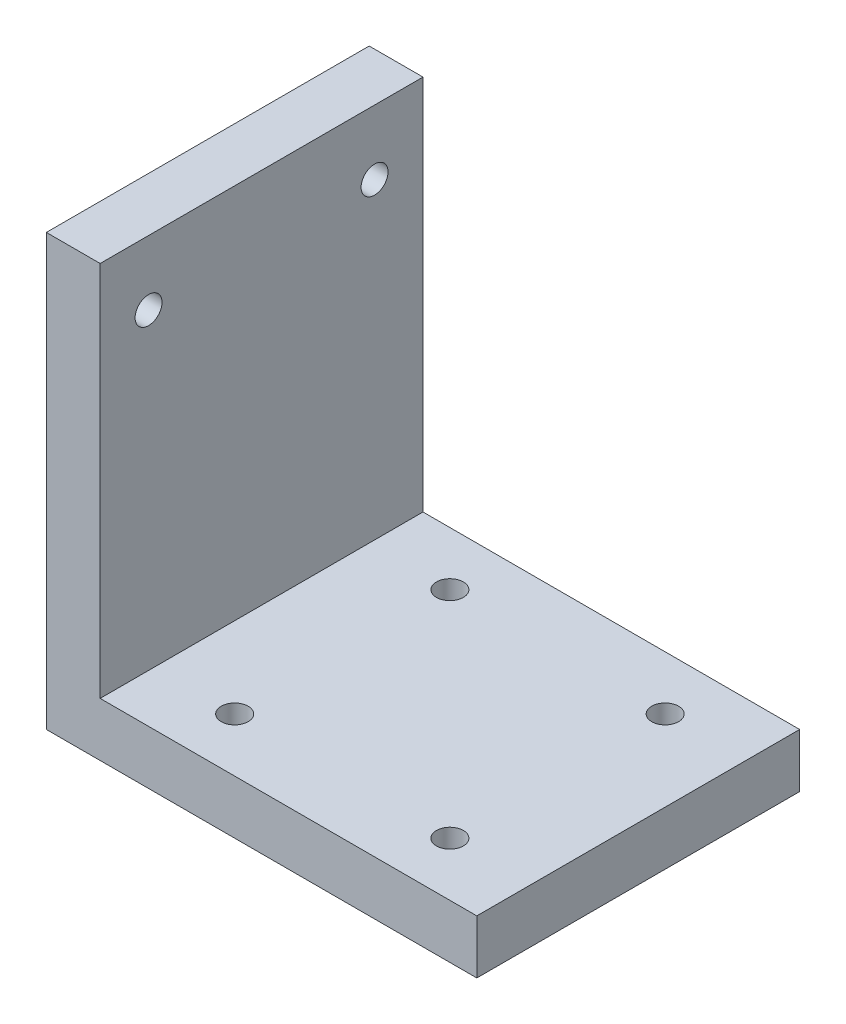
ISO-10303-21;
HEADER;
FILE_DESCRIPTION(('STEP AP214'),'2;1');
FILE_NAME('part.step','',(''),(''),'','','');
FILE_SCHEMA(('AUTOMOTIVE_DESIGN { 1 0 10303 214 1 1 1 1 }'));
ENDSEC;
DATA;
#1=APPLICATION_CONTEXT('core data for automotive mechanical design processes');
#2=APPLICATION_PROTOCOL_DEFINITION('international standard','automotive_design',2000,#1);
#3=PRODUCT_CONTEXT('',#1,'mechanical');
#4=PRODUCT('Part','Part','',(#3));
#5=PRODUCT_RELATED_PRODUCT_CATEGORY('part','',(#4));
#6=PRODUCT_DEFINITION_FORMATION('','',#4);
#7=PRODUCT_DEFINITION_CONTEXT('part definition',#1,'design');
#8=PRODUCT_DEFINITION('design','',#6,#7);
#9=PRODUCT_DEFINITION_SHAPE('','',#8);
#10=(LENGTH_UNIT() NAMED_UNIT(*) SI_UNIT(.MILLI.,.METRE.));
#11=(NAMED_UNIT(*) PLANE_ANGLE_UNIT() SI_UNIT($,.RADIAN.));
#12=(NAMED_UNIT(*) SI_UNIT($,.STERADIAN.) SOLID_ANGLE_UNIT());
#13=UNCERTAINTY_MEASURE_WITH_UNIT(LENGTH_MEASURE(1.E-05),#10,'distance_accuracy_value','');
#14=(GEOMETRIC_REPRESENTATION_CONTEXT(3) GLOBAL_UNCERTAINTY_ASSIGNED_CONTEXT((#13)) GLOBAL_UNIT_ASSIGNED_CONTEXT((#10,
#11,#12)) REPRESENTATION_CONTEXT('',''));
#15=CARTESIAN_POINT('',(0.,0.,0.));
#16=DIRECTION('',(0.,0.,1.));
#17=DIRECTION('',(1.,0.,0.));
#18=AXIS2_PLACEMENT_3D('',#15,#16,#17);
#19=CARTESIAN_POINT('',(0.,80.,60.));
#20=DIRECTION('',(0.,-1.,0.));
#21=DIRECTION('',(0.,0.,-1.));
#22=AXIS2_PLACEMENT_3D('',#19,#20,#21);
#23=PLANE('',#22);
#24=DIRECTION('',(-1.,0.,0.));
#25=VECTOR('',#24,1.);
#26=CARTESIAN_POINT('',(0.,80.,0.));
#27=LINE('',#26,#25);
#28=CARTESIAN_POINT('',(10.,80.,0.));
#29=VERTEX_POINT('',#28);
#30=CARTESIAN_POINT('',(0.,80.,0.));
#31=VERTEX_POINT('',#30);
#32=EDGE_CURVE('E133',#29,#31,#27,.T.);
#33=ORIENTED_EDGE('',*,*,#32,.T.);
#34=DIRECTION('',(0.,0.,-1.));
#35=VECTOR('',#34,1.);
#36=CARTESIAN_POINT('',(0.,80.,60.));
#37=LINE('',#36,#35);
#38=CARTESIAN_POINT('',(0.,80.,60.));
#39=VERTEX_POINT('',#38);
#40=EDGE_CURVE('E11',#39,#31,#37,.T.);
#41=ORIENTED_EDGE('',*,*,#40,.F.);
#42=DIRECTION('',(-1.,0.,0.));
#43=VECTOR('',#42,1.);
#44=CARTESIAN_POINT('',(0.,80.,60.));
#45=LINE('',#44,#43);
#46=CARTESIAN_POINT('',(10.,80.,60.));
#47=VERTEX_POINT('',#46);
#48=EDGE_CURVE('E150',#47,#39,#45,.T.);
#49=ORIENTED_EDGE('',*,*,#48,.F.);
#50=DIRECTION('',(0.,0.,-1.));
#51=VECTOR('',#50,1.);
#52=CARTESIAN_POINT('',(10.,80.,60.));
#53=LINE('',#52,#51);
#54=EDGE_CURVE('E129',#47,#29,#53,.T.);
#55=ORIENTED_EDGE('',*,*,#54,.T.);
#56=EDGE_LOOP('',(#33,#41,#49,#55));
#57=FACE_BOUND('',#56,.T.);
#58=ADVANCED_FACE('F42',(#57),#23,.F.);
#59=CARTESIAN_POINT('',(0.,80.,60.));
#60=DIRECTION('',(1.,0.,0.));
#61=DIRECTION('',(0.,1.,0.));
#62=AXIS2_PLACEMENT_3D('',#59,#60,#61);
#63=PLANE('',#62);
#64=CARTESIAN_POINT('',(0.,68.,8.99999999999998));
#65=DIRECTION('',(-1.,0.,0.));
#66=DIRECTION('',(0.,0.,1.));
#67=AXIS2_PLACEMENT_3D('',#64,#65,#66);
#68=CIRCLE('',#67,2.49999999999999);
#69=CARTESIAN_POINT('',(0.,68.,11.5));
#70=VERTEX_POINT('',#69);
#71=EDGE_CURVE('E389',#70,#70,#68,.T.);
#72=ORIENTED_EDGE('',*,*,#71,.F.);
#73=EDGE_LOOP('',(#72));
#74=FACE_BOUND('',#73,.T.);
#75=CARTESIAN_POINT('',(0.,68.,51.));
#76=DIRECTION('',(-1.,0.,0.));
#77=DIRECTION('',(0.,0.,1.));
#78=AXIS2_PLACEMENT_3D('',#75,#76,#77);
#79=CIRCLE('',#78,2.49999999999999);
#80=CARTESIAN_POINT('',(0.,68.,53.5));
#81=VERTEX_POINT('',#80);
#82=EDGE_CURVE('E178',#81,#81,#79,.T.);
#83=ORIENTED_EDGE('',*,*,#82,.F.);
#84=EDGE_LOOP('',(#83));
#85=FACE_BOUND('',#84,.T.);
#86=DIRECTION('',(0.,-1.,0.));
#87=VECTOR('',#86,1.);
#88=CARTESIAN_POINT('',(0.,80.,0.));
#89=LINE('',#88,#87);
#90=CARTESIAN_POINT('',(0.,0.,0.));
#91=VERTEX_POINT('',#90);
#92=EDGE_CURVE('E137',#31,#91,#89,.T.);
#93=ORIENTED_EDGE('',*,*,#92,.T.);
#94=DIRECTION('',(0.,0.,-1.));
#95=VECTOR('',#94,1.);
#96=CARTESIAN_POINT('',(0.,0.,60.));
#97=LINE('',#96,#95);
#98=CARTESIAN_POINT('',(0.,0.,60.));
#99=VERTEX_POINT('',#98);
#100=EDGE_CURVE('E52',#99,#91,#97,.T.);
#101=ORIENTED_EDGE('',*,*,#100,.F.);
#102=DIRECTION('',(0.,-1.,0.));
#103=VECTOR('',#102,1.);
#104=CARTESIAN_POINT('',(0.,80.,60.));
#105=LINE('',#104,#103);
#106=EDGE_CURVE('E98',#39,#99,#105,.T.);
#107=ORIENTED_EDGE('',*,*,#106,.F.);
#108=ORIENTED_EDGE('',*,*,#40,.T.);
#109=EDGE_LOOP('',(#93,#101,#107,#108));
#110=FACE_BOUND('',#109,.T.);
#111=ADVANCED_FACE('F206',(#74,#85,#110),#63,.F.);
#112=CARTESIAN_POINT('',(0.,0.,60.));
#113=DIRECTION('',(0.,1.,0.));
#114=DIRECTION('',(0.,0.,1.));
#115=AXIS2_PLACEMENT_3D('',#112,#113,#114);
#116=PLANE('',#115);
#117=CARTESIAN_POINT('',(65.,0.,50.));
#118=DIRECTION('',(0.,-1.,0.));
#119=DIRECTION('',(0.,0.,-1.));
#120=AXIS2_PLACEMENT_3D('',#117,#118,#119);
#121=CIRCLE('',#120,2.5);
#122=CARTESIAN_POINT('',(65.,0.,47.5));
#123=VERTEX_POINT('',#122);
#124=EDGE_CURVE('E163',#123,#123,#121,.T.);
#125=ORIENTED_EDGE('',*,*,#124,.F.);
#126=EDGE_LOOP('',(#125));
#127=FACE_BOUND('',#126,.T.);
#128=CARTESIAN_POINT('',(65.,0.,10.));
#129=DIRECTION('',(0.,-1.,0.));
#130=DIRECTION('',(0.,0.,-1.));
#131=AXIS2_PLACEMENT_3D('',#128,#129,#130);
#132=CIRCLE('',#131,2.5);
#133=CARTESIAN_POINT('',(65.,0.,7.5));
#134=VERTEX_POINT('',#133);
#135=EDGE_CURVE('E162',#134,#134,#132,.T.);
#136=ORIENTED_EDGE('',*,*,#135,.F.);
#137=EDGE_LOOP('',(#136));
#138=FACE_BOUND('',#137,.T.);
#139=CARTESIAN_POINT('',(25.,0.,10.));
#140=DIRECTION('',(0.,-1.,0.));
#141=DIRECTION('',(0.,0.,-1.));
#142=AXIS2_PLACEMENT_3D('',#139,#140,#141);
#143=CIRCLE('',#142,2.5);
#144=CARTESIAN_POINT('',(25.,0.,7.5));
#145=VERTEX_POINT('',#144);
#146=EDGE_CURVE('E185',#145,#145,#143,.T.);
#147=ORIENTED_EDGE('',*,*,#146,.F.);
#148=EDGE_LOOP('',(#147));
#149=FACE_BOUND('',#148,.T.);
#150=CARTESIAN_POINT('',(25.,0.,50.));
#151=DIRECTION('',(0.,-1.,0.));
#152=DIRECTION('',(0.,0.,-1.));
#153=AXIS2_PLACEMENT_3D('',#150,#151,#152);
#154=CIRCLE('',#153,2.5);
#155=CARTESIAN_POINT('',(25.,0.,47.5));
#156=VERTEX_POINT('',#155);
#157=EDGE_CURVE('E193',#156,#156,#154,.T.);
#158=ORIENTED_EDGE('',*,*,#157,.F.);
#159=EDGE_LOOP('',(#158));
#160=FACE_BOUND('',#159,.T.);
#161=DIRECTION('',(1.,0.,0.));
#162=VECTOR('',#161,1.);
#163=CARTESIAN_POINT('',(0.,0.,0.));
#164=LINE('',#163,#162);
#165=CARTESIAN_POINT('',(80.,0.,0.));
#166=VERTEX_POINT('',#165);
#167=EDGE_CURVE('E141',#91,#166,#164,.T.);
#168=ORIENTED_EDGE('',*,*,#167,.T.);
#169=DIRECTION('',(0.,0.,-1.));
#170=VECTOR('',#169,1.);
#171=CARTESIAN_POINT('',(80.,0.,60.));
#172=LINE('',#171,#170);
#173=CARTESIAN_POINT('',(80.,0.,60.));
#174=VERTEX_POINT('',#173);
#175=EDGE_CURVE('E122',#174,#166,#172,.T.);
#176=ORIENTED_EDGE('',*,*,#175,.F.);
#177=DIRECTION('',(1.,0.,0.));
#178=VECTOR('',#177,1.);
#179=CARTESIAN_POINT('',(0.,0.,60.));
#180=LINE('',#179,#178);
#181=EDGE_CURVE('E111',#99,#174,#180,.T.);
#182=ORIENTED_EDGE('',*,*,#181,.F.);
#183=ORIENTED_EDGE('',*,*,#100,.T.);
#184=EDGE_LOOP('',(#168,#176,#182,#183));
#185=FACE_BOUND('',#184,.T.);
#186=ADVANCED_FACE('F209',(#127,#138,#149,#160,#185),#116,.F.);
#187=CARTESIAN_POINT('',(80.,10.,60.));
#188=DIRECTION('',(-1.,0.,0.));
#189=DIRECTION('',(0.,0.,1.));
#190=AXIS2_PLACEMENT_3D('',#187,#188,#189);
#191=PLANE('',#190);
#192=DIRECTION('',(0.,1.,0.));
#193=VECTOR('',#192,1.);
#194=CARTESIAN_POINT('',(80.,10.,0.));
#195=LINE('',#194,#193);
#196=CARTESIAN_POINT('',(80.,10.,0.));
#197=VERTEX_POINT('',#196);
#198=EDGE_CURVE('E120',#166,#197,#195,.T.);
#199=ORIENTED_EDGE('',*,*,#198,.T.);
#200=DIRECTION('',(0.,0.,-1.));
#201=VECTOR('',#200,1.);
#202=CARTESIAN_POINT('',(80.,10.,60.));
#203=LINE('',#202,#201);
#204=CARTESIAN_POINT('',(80.,10.,60.));
#205=VERTEX_POINT('',#204);
#206=EDGE_CURVE('E117',#205,#197,#203,.T.);
#207=ORIENTED_EDGE('',*,*,#206,.F.);
#208=DIRECTION('',(0.,1.,0.));
#209=VECTOR('',#208,1.);
#210=CARTESIAN_POINT('',(80.,10.,60.));
#211=LINE('',#210,#209);
#212=EDGE_CURVE('E105',#174,#205,#211,.T.);
#213=ORIENTED_EDGE('',*,*,#212,.F.);
#214=ORIENTED_EDGE('',*,*,#175,.T.);
#215=EDGE_LOOP('',(#199,#207,#213,#214));
#216=FACE_BOUND('',#215,.T.);
#217=ADVANCED_FACE('F118',(#216),#191,.F.);
#218=CARTESIAN_POINT('',(10.,10.,60.));
#219=DIRECTION('',(0.,-1.,0.));
#220=DIRECTION('',(0.,0.,-1.));
#221=AXIS2_PLACEMENT_3D('',#218,#219,#220);
#222=PLANE('',#221);
#223=CARTESIAN_POINT('',(65.,10.,50.));
#224=DIRECTION('',(0.,-1.,0.));
#225=DIRECTION('',(0.,0.,-1.));
#226=AXIS2_PLACEMENT_3D('',#223,#224,#225);
#227=CIRCLE('',#226,2.5);
#228=CARTESIAN_POINT('',(65.,10.,47.5));
#229=VERTEX_POINT('',#228);
#230=EDGE_CURVE('E159',#229,#229,#227,.T.);
#231=ORIENTED_EDGE('',*,*,#230,.T.);
#232=EDGE_LOOP('',(#231));
#233=FACE_BOUND('',#232,.T.);
#234=CARTESIAN_POINT('',(65.,10.,10.));
#235=DIRECTION('',(0.,-1.,0.));
#236=DIRECTION('',(0.,0.,-1.));
#237=AXIS2_PLACEMENT_3D('',#234,#235,#236);
#238=CIRCLE('',#237,2.5);
#239=CARTESIAN_POINT('',(65.,10.,7.5));
#240=VERTEX_POINT('',#239);
#241=EDGE_CURVE('E169',#240,#240,#238,.T.);
#242=ORIENTED_EDGE('',*,*,#241,.T.);
#243=EDGE_LOOP('',(#242));
#244=FACE_BOUND('',#243,.T.);
#245=CARTESIAN_POINT('',(25.,10.,10.));
#246=DIRECTION('',(0.,-1.,0.));
#247=DIRECTION('',(0.,0.,-1.));
#248=AXIS2_PLACEMENT_3D('',#245,#246,#247);
#249=CIRCLE('',#248,2.5);
#250=CARTESIAN_POINT('',(25.,10.,7.5));
#251=VERTEX_POINT('',#250);
#252=EDGE_CURVE('E189',#251,#251,#249,.T.);
#253=ORIENTED_EDGE('',*,*,#252,.T.);
#254=EDGE_LOOP('',(#253));
#255=FACE_BOUND('',#254,.T.);
#256=CARTESIAN_POINT('',(25.,10.,50.));
#257=DIRECTION('',(0.,-1.,0.));
#258=DIRECTION('',(0.,0.,-1.));
#259=AXIS2_PLACEMENT_3D('',#256,#257,#258);
#260=CIRCLE('',#259,2.5);
#261=CARTESIAN_POINT('',(25.,10.,47.5));
#262=VERTEX_POINT('',#261);
#263=EDGE_CURVE('E138',#262,#262,#260,.T.);
#264=ORIENTED_EDGE('',*,*,#263,.T.);
#265=EDGE_LOOP('',(#264));
#266=FACE_BOUND('',#265,.T.);
#267=DIRECTION('',(-1.,0.,0.));
#268=VECTOR('',#267,1.);
#269=CARTESIAN_POINT('',(10.,10.,0.));
#270=LINE('',#269,#268);
#271=CARTESIAN_POINT('',(10.,10.,0.));
#272=VERTEX_POINT('',#271);
#273=EDGE_CURVE('E84',#197,#272,#270,.T.);
#274=ORIENTED_EDGE('',*,*,#273,.T.);
#275=DIRECTION('',(0.,0.,-1.));
#276=VECTOR('',#275,1.);
#277=CARTESIAN_POINT('',(10.,10.,60.));
#278=LINE('',#277,#276);
#279=CARTESIAN_POINT('',(10.,10.,60.));
#280=VERTEX_POINT('',#279);
#281=EDGE_CURVE('E123',#280,#272,#278,.T.);
#282=ORIENTED_EDGE('',*,*,#281,.F.);
#283=DIRECTION('',(-1.,0.,0.));
#284=VECTOR('',#283,1.);
#285=CARTESIAN_POINT('',(10.,10.,60.));
#286=LINE('',#285,#284);
#287=EDGE_CURVE('E109',#205,#280,#286,.T.);
#288=ORIENTED_EDGE('',*,*,#287,.F.);
#289=ORIENTED_EDGE('',*,*,#206,.T.);
#290=EDGE_LOOP('',(#274,#282,#288,#289));
#291=FACE_BOUND('',#290,.T.);
#292=ADVANCED_FACE('F125',(#233,#244,#255,#266,#291),#222,.F.);
#293=CARTESIAN_POINT('',(10.,80.,60.));
#294=DIRECTION('',(-1.,0.,0.));
#295=DIRECTION('',(0.,0.,1.));
#296=AXIS2_PLACEMENT_3D('',#293,#294,#295);
#297=PLANE('',#296);
#298=CARTESIAN_POINT('',(10.,68.,8.99999999999998));
#299=DIRECTION('',(-1.,0.,0.));
#300=DIRECTION('',(0.,0.,1.));
#301=AXIS2_PLACEMENT_3D('',#298,#299,#300);
#302=CIRCLE('',#301,2.49999999999999);
#303=CARTESIAN_POINT('',(10.,68.,11.5));
#304=VERTEX_POINT('',#303);
#305=EDGE_CURVE('E45',#304,#304,#302,.T.);
#306=ORIENTED_EDGE('',*,*,#305,.T.);
#307=EDGE_LOOP('',(#306));
#308=FACE_BOUND('',#307,.T.);
#309=CARTESIAN_POINT('',(10.,68.,51.));
#310=DIRECTION('',(-1.,0.,0.));
#311=DIRECTION('',(0.,0.,1.));
#312=AXIS2_PLACEMENT_3D('',#309,#310,#311);
#313=CIRCLE('',#312,2.49999999999999);
#314=CARTESIAN_POINT('',(10.,68.,53.5));
#315=VERTEX_POINT('',#314);
#316=EDGE_CURVE('E172',#315,#315,#313,.T.);
#317=ORIENTED_EDGE('',*,*,#316,.T.);
#318=EDGE_LOOP('',(#317));
#319=FACE_BOUND('',#318,.T.);
#320=DIRECTION('',(0.,1.,0.));
#321=VECTOR('',#320,1.);
#322=CARTESIAN_POINT('',(10.,80.,0.));
#323=LINE('',#322,#321);
#324=EDGE_CURVE('E90',#272,#29,#323,.T.);
#325=ORIENTED_EDGE('',*,*,#324,.T.);
#326=ORIENTED_EDGE('',*,*,#54,.F.);
#327=DIRECTION('',(0.,1.,0.));
#328=VECTOR('',#327,1.);
#329=CARTESIAN_POINT('',(10.,80.,60.));
#330=LINE('',#329,#328);
#331=EDGE_CURVE('E61',#280,#47,#330,.T.);
#332=ORIENTED_EDGE('',*,*,#331,.F.);
#333=ORIENTED_EDGE('',*,*,#281,.T.);
#334=EDGE_LOOP('',(#325,#326,#332,#333));
#335=FACE_BOUND('',#334,.T.);
#336=ADVANCED_FACE('F214',(#308,#319,#335),#297,.F.);
#337=CARTESIAN_POINT('',(0.,0.,60.));
#338=DIRECTION('',(0.,0.,-1.));
#339=DIRECTION('',(-1.,0.,0.));
#340=AXIS2_PLACEMENT_3D('',#337,#338,#339);
#341=PLANE('',#340);
#342=ORIENTED_EDGE('',*,*,#48,.T.);
#343=ORIENTED_EDGE('',*,*,#106,.T.);
#344=ORIENTED_EDGE('',*,*,#181,.T.);
#345=ORIENTED_EDGE('',*,*,#212,.T.);
#346=ORIENTED_EDGE('',*,*,#287,.T.);
#347=ORIENTED_EDGE('',*,*,#331,.T.);
#348=EDGE_LOOP('',(#342,#343,#344,#345,#346,#347));
#349=FACE_BOUND('',#348,.T.);
#350=ADVANCED_FACE('F107',(#349),#341,.F.);
#351=CARTESIAN_POINT('',(0.,0.,0.));
#352=DIRECTION('',(0.,0.,-1.));
#353=DIRECTION('',(-1.,0.,0.));
#354=AXIS2_PLACEMENT_3D('',#351,#352,#353);
#355=PLANE('',#354);
#356=ORIENTED_EDGE('',*,*,#32,.F.);
#357=ORIENTED_EDGE('',*,*,#324,.F.);
#358=ORIENTED_EDGE('',*,*,#273,.F.);
#359=ORIENTED_EDGE('',*,*,#198,.F.);
#360=ORIENTED_EDGE('',*,*,#167,.F.);
#361=ORIENTED_EDGE('',*,*,#92,.F.);
#362=EDGE_LOOP('',(#356,#357,#358,#359,#360,#361));
#363=FACE_BOUND('',#362,.T.);
#364=ADVANCED_FACE('F212',(#363),#355,.T.);
#365=CARTESIAN_POINT('',(25.,0.,50.));
#366=DIRECTION('',(0.,-1.,0.));
#367=DIRECTION('',(0.,0.,-1.));
#368=AXIS2_PLACEMENT_3D('',#365,#366,#367);
#369=CYLINDRICAL_SURFACE('',#368,2.5);
#370=ORIENTED_EDGE('',*,*,#157,.T.);
#371=EDGE_LOOP('',(#370));
#372=FACE_BOUND('',#371,.T.);
#373=ORIENTED_EDGE('',*,*,#263,.F.);
#374=EDGE_LOOP('',(#373));
#375=FACE_BOUND('',#374,.T.);
#376=ADVANCED_FACE('F269',(#372,#375),#369,.F.);
#377=CARTESIAN_POINT('',(25.,0.,10.));
#378=DIRECTION('',(0.,-1.,0.));
#379=DIRECTION('',(0.,0.,-1.));
#380=AXIS2_PLACEMENT_3D('',#377,#378,#379);
#381=CYLINDRICAL_SURFACE('',#380,2.5);
#382=ORIENTED_EDGE('',*,*,#146,.T.);
#383=EDGE_LOOP('',(#382));
#384=FACE_BOUND('',#383,.T.);
#385=ORIENTED_EDGE('',*,*,#252,.F.);
#386=EDGE_LOOP('',(#385));
#387=FACE_BOUND('',#386,.T.);
#388=ADVANCED_FACE('F275',(#384,#387),#381,.F.);
#389=CARTESIAN_POINT('',(65.,0.,10.));
#390=DIRECTION('',(0.,-1.,0.));
#391=DIRECTION('',(0.,0.,-1.));
#392=AXIS2_PLACEMENT_3D('',#389,#390,#391);
#393=CYLINDRICAL_SURFACE('',#392,2.5);
#394=ORIENTED_EDGE('',*,*,#135,.T.);
#395=EDGE_LOOP('',(#394));
#396=FACE_BOUND('',#395,.T.);
#397=ORIENTED_EDGE('',*,*,#241,.F.);
#398=EDGE_LOOP('',(#397));
#399=FACE_BOUND('',#398,.T.);
#400=ADVANCED_FACE('F283',(#396,#399),#393,.F.);
#401=CARTESIAN_POINT('',(65.,0.,50.));
#402=DIRECTION('',(0.,-1.,0.));
#403=DIRECTION('',(0.,0.,-1.));
#404=AXIS2_PLACEMENT_3D('',#401,#402,#403);
#405=CYLINDRICAL_SURFACE('',#404,2.5);
#406=ORIENTED_EDGE('',*,*,#124,.T.);
#407=EDGE_LOOP('',(#406));
#408=FACE_BOUND('',#407,.T.);
#409=ORIENTED_EDGE('',*,*,#230,.F.);
#410=EDGE_LOOP('',(#409));
#411=FACE_BOUND('',#410,.T.);
#412=ADVANCED_FACE('F291',(#408,#411),#405,.F.);
#413=CARTESIAN_POINT('',(0.,68.,51.));
#414=DIRECTION('',(-1.,0.,0.));
#415=DIRECTION('',(0.,0.,1.));
#416=AXIS2_PLACEMENT_3D('',#413,#414,#415);
#417=CYLINDRICAL_SURFACE('',#416,2.49999999999999);
#418=ORIENTED_EDGE('',*,*,#82,.T.);
#419=EDGE_LOOP('',(#418));
#420=FACE_BOUND('',#419,.T.);
#421=ORIENTED_EDGE('',*,*,#316,.F.);
#422=EDGE_LOOP('',(#421));
#423=FACE_BOUND('',#422,.T.);
#424=ADVANCED_FACE('F299',(#420,#423),#417,.F.);
#425=CARTESIAN_POINT('',(0.,68.,8.99999999999998));
#426=DIRECTION('',(-1.,0.,0.));
#427=DIRECTION('',(0.,0.,1.));
#428=AXIS2_PLACEMENT_3D('',#425,#426,#427);
#429=CYLINDRICAL_SURFACE('',#428,2.49999999999999);
#430=ORIENTED_EDGE('',*,*,#71,.T.);
#431=EDGE_LOOP('',(#430));
#432=FACE_BOUND('',#431,.T.);
#433=ORIENTED_EDGE('',*,*,#305,.F.);
#434=EDGE_LOOP('',(#433));
#435=FACE_BOUND('',#434,.T.);
#436=ADVANCED_FACE('F306',(#432,#435),#429,.F.);
#437=CLOSED_SHELL('',(#58,#111,#186,#217,#292,#336,#350,#364,#376,#388,#400,#412,#424,#436));
#438=MANIFOLD_SOLID_BREP('B2',#437);
#439=ADVANCED_BREP_SHAPE_REPRESENTATION('',(#18,#438),#14);
#440=SHAPE_DEFINITION_REPRESENTATION(#9,#439);
ENDSEC;
END-ISO-10303-21;
